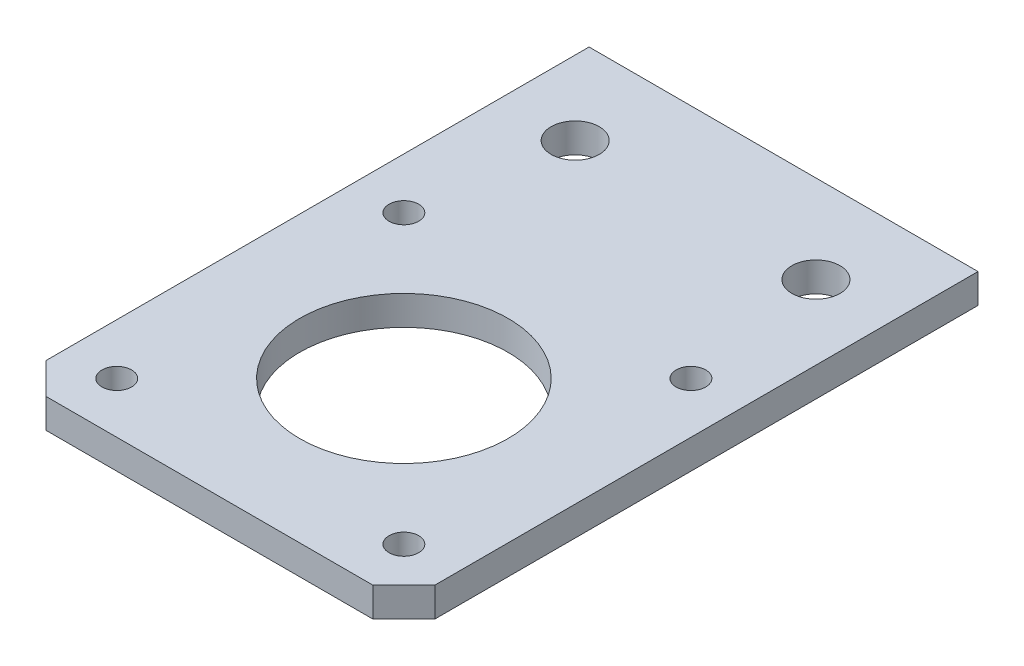
ISO-10303-21;
HEADER;
FILE_DESCRIPTION(('STEP AP214'),'2;1');
FILE_NAME('part.step','',(''),(''),'','','');
FILE_SCHEMA(('AUTOMOTIVE_DESIGN { 1 0 10303 214 1 1 1 1 }'));
ENDSEC;
DATA;
#1=APPLICATION_CONTEXT('core data for automotive mechanical design processes');
#2=APPLICATION_PROTOCOL_DEFINITION('international standard','automotive_design',2000,#1);
#3=PRODUCT_CONTEXT('',#1,'mechanical');
#4=PRODUCT('Part','Part','',(#3));
#5=PRODUCT_RELATED_PRODUCT_CATEGORY('part','',(#4));
#6=PRODUCT_DEFINITION_FORMATION('','',#4);
#7=PRODUCT_DEFINITION_CONTEXT('part definition',#1,'design');
#8=PRODUCT_DEFINITION('design','',#6,#7);
#9=PRODUCT_DEFINITION_SHAPE('','',#8);
#10=(LENGTH_UNIT() NAMED_UNIT(*) SI_UNIT(.MILLI.,.METRE.));
#11=(NAMED_UNIT(*) PLANE_ANGLE_UNIT() SI_UNIT($,.RADIAN.));
#12=(NAMED_UNIT(*) SI_UNIT($,.STERADIAN.) SOLID_ANGLE_UNIT());
#13=UNCERTAINTY_MEASURE_WITH_UNIT(LENGTH_MEASURE(1.E-05),#10,'distance_accuracy_value','');
#14=(GEOMETRIC_REPRESENTATION_CONTEXT(3) GLOBAL_UNCERTAINTY_ASSIGNED_CONTEXT((#13)) GLOBAL_UNIT_ASSIGNED_CONTEXT((#10,
#11,#12)) REPRESENTATION_CONTEXT('',''));
#15=CARTESIAN_POINT('',(0.,0.,0.));
#16=DIRECTION('',(0.,0.,1.));
#17=DIRECTION('',(1.,0.,0.));
#18=AXIS2_PLACEMENT_3D('',#15,#16,#17);
#19=CARTESIAN_POINT('',(0.,3.175,-41.));
#20=DIRECTION('',(0.,0.,1.));
#21=DIRECTION('',(1.,0.,0.));
#22=AXIS2_PLACEMENT_3D('',#19,#20,#21);
#23=PLANE('',#22);
#24=DIRECTION('',(-1.,0.,0.));
#25=VECTOR('',#24,1.);
#26=CARTESIAN_POINT('',(0.,0.,-41.));
#27=LINE('',#26,#25);
#28=CARTESIAN_POINT('',(21.,0.,-41.));
#29=VERTEX_POINT('',#28);
#30=CARTESIAN_POINT('',(-21.,0.,-41.));
#31=VERTEX_POINT('',#30);
#32=EDGE_CURVE('E138',#29,#31,#27,.T.);
#33=ORIENTED_EDGE('',*,*,#32,.T.);
#34=DIRECTION('',(0.,-1.,0.));
#35=VECTOR('',#34,1.);
#36=CARTESIAN_POINT('',(-21.,3.175,-41.));
#37=LINE('',#36,#35);
#38=CARTESIAN_POINT('',(-21.,3.175,-41.));
#39=VERTEX_POINT('',#38);
#40=EDGE_CURVE('E11',#39,#31,#37,.T.);
#41=ORIENTED_EDGE('',*,*,#40,.F.);
#42=DIRECTION('',(-1.,0.,0.));
#43=VECTOR('',#42,1.);
#44=CARTESIAN_POINT('',(0.,3.175,-41.));
#45=LINE('',#44,#43);
#46=CARTESIAN_POINT('',(21.,3.175,-41.));
#47=VERTEX_POINT('',#46);
#48=EDGE_CURVE('E178',#47,#39,#45,.T.);
#49=ORIENTED_EDGE('',*,*,#48,.F.);
#50=DIRECTION('',(0.,-1.,0.));
#51=VECTOR('',#50,1.);
#52=CARTESIAN_POINT('',(21.,3.175,-41.));
#53=LINE('',#52,#51);
#54=EDGE_CURVE('E131',#47,#29,#53,.T.);
#55=ORIENTED_EDGE('',*,*,#54,.T.);
#56=EDGE_LOOP('',(#33,#41,#49,#55));
#57=FACE_BOUND('',#56,.T.);
#58=ADVANCED_FACE('F32',(#57),#23,.F.);
#59=CARTESIAN_POINT('',(-21.,3.175,0.));
#60=DIRECTION('',(1.,0.,0.));
#61=DIRECTION('',(0.,0.,-1.));
#62=AXIS2_PLACEMENT_3D('',#59,#60,#61);
#63=PLANE('',#62);
#64=DIRECTION('',(0.,0.,1.));
#65=VECTOR('',#64,1.);
#66=CARTESIAN_POINT('',(-21.,0.,0.));
#67=LINE('',#66,#65);
#68=CARTESIAN_POINT('',(-21.,0.,17.645));
#69=VERTEX_POINT('',#68);
#70=EDGE_CURVE('E141',#31,#69,#67,.T.);
#71=ORIENTED_EDGE('',*,*,#70,.T.);
#72=DIRECTION('',(0.,-1.,0.));
#73=VECTOR('',#72,1.);
#74=CARTESIAN_POINT('',(-21.,3.175,17.645));
#75=LINE('',#74,#73);
#76=CARTESIAN_POINT('',(-21.,3.175,17.645));
#77=VERTEX_POINT('',#76);
#78=EDGE_CURVE('E41',#77,#69,#75,.T.);
#79=ORIENTED_EDGE('',*,*,#78,.F.);
#80=DIRECTION('',(0.,0.,1.));
#81=VECTOR('',#80,1.);
#82=CARTESIAN_POINT('',(-21.,3.175,0.));
#83=LINE('',#82,#81);
#84=EDGE_CURVE('E82',#39,#77,#83,.T.);
#85=ORIENTED_EDGE('',*,*,#84,.F.);
#86=ORIENTED_EDGE('',*,*,#40,.T.);
#87=EDGE_LOOP('',(#71,#79,#85,#86));
#88=FACE_BOUND('',#87,.T.);
#89=ADVANCED_FACE('F194',(#88),#63,.F.);
#90=CARTESIAN_POINT('',(-19.3225,3.175,19.3225));
#91=DIRECTION('',(0.707106781186548,0.,-0.707106781186548));
#92=DIRECTION('',(-0.707106781186548,0.,-0.707106781186548));
#93=AXIS2_PLACEMENT_3D('',#90,#91,#92);
#94=PLANE('',#93);
#95=DIRECTION('',(0.707106781186548,0.,0.707106781186548));
#96=VECTOR('',#95,1.);
#97=CARTESIAN_POINT('',(-19.3225,0.,19.3225));
#98=LINE('',#97,#96);
#99=CARTESIAN_POINT('',(-17.645,0.,21.));
#100=VERTEX_POINT('',#99);
#101=EDGE_CURVE('E143',#69,#100,#98,.T.);
#102=ORIENTED_EDGE('',*,*,#101,.T.);
#103=DIRECTION('',(0.,-1.,0.));
#104=VECTOR('',#103,1.);
#105=CARTESIAN_POINT('',(-17.645,3.175,21.));
#106=LINE('',#105,#104);
#107=CARTESIAN_POINT('',(-17.645,3.175,21.));
#108=VERTEX_POINT('',#107);
#109=EDGE_CURVE('E109',#108,#100,#106,.T.);
#110=ORIENTED_EDGE('',*,*,#109,.F.);
#111=DIRECTION('',(0.707106781186548,0.,0.707106781186548));
#112=VECTOR('',#111,1.);
#113=CARTESIAN_POINT('',(-19.3225,3.175,19.3225));
#114=LINE('',#113,#112);
#115=EDGE_CURVE('E96',#77,#108,#114,.T.);
#116=ORIENTED_EDGE('',*,*,#115,.F.);
#117=ORIENTED_EDGE('',*,*,#78,.T.);
#118=EDGE_LOOP('',(#102,#110,#116,#117));
#119=FACE_BOUND('',#118,.T.);
#120=ADVANCED_FACE('F170',(#119),#94,.F.);
#121=CARTESIAN_POINT('',(0.,3.175,21.));
#122=DIRECTION('',(0.,0.,-1.));
#123=DIRECTION('',(-1.,0.,0.));
#124=AXIS2_PLACEMENT_3D('',#121,#122,#123);
#125=PLANE('',#124);
#126=DIRECTION('',(1.,0.,0.));
#127=VECTOR('',#126,1.);
#128=CARTESIAN_POINT('',(0.,0.,21.));
#129=LINE('',#128,#127);
#130=CARTESIAN_POINT('',(17.645,0.,21.));
#131=VERTEX_POINT('',#130);
#132=EDGE_CURVE('E105',#100,#131,#129,.T.);
#133=ORIENTED_EDGE('',*,*,#132,.T.);
#134=DIRECTION('',(0.,-1.,0.));
#135=VECTOR('',#134,1.);
#136=CARTESIAN_POINT('',(17.645,3.175,21.));
#137=LINE('',#136,#135);
#138=CARTESIAN_POINT('',(17.645,3.175,21.));
#139=VERTEX_POINT('',#138);
#140=EDGE_CURVE('E102',#139,#131,#137,.T.);
#141=ORIENTED_EDGE('',*,*,#140,.F.);
#142=DIRECTION('',(1.,0.,0.));
#143=VECTOR('',#142,1.);
#144=CARTESIAN_POINT('',(0.,3.175,21.));
#145=LINE('',#144,#143);
#146=EDGE_CURVE('E89',#108,#139,#145,.T.);
#147=ORIENTED_EDGE('',*,*,#146,.F.);
#148=ORIENTED_EDGE('',*,*,#109,.T.);
#149=EDGE_LOOP('',(#133,#141,#147,#148));
#150=FACE_BOUND('',#149,.T.);
#151=ADVANCED_FACE('F103',(#150),#125,.F.);
#152=CARTESIAN_POINT('',(19.3225,3.175,19.3225));
#153=DIRECTION('',(0.707106781186548,0.,0.707106781186548));
#154=DIRECTION('',(0.707106781186548,0.,-0.707106781186548));
#155=AXIS2_PLACEMENT_3D('',#152,#153,#154);
#156=PLANE('',#155);
#157=DIRECTION('',(-0.707106781186548,0.,0.707106781186548));
#158=VECTOR('',#157,1.);
#159=CARTESIAN_POINT('',(19.3225,0.,19.3225));
#160=LINE('',#159,#158);
#161=CARTESIAN_POINT('',(21.,0.,17.645));
#162=VERTEX_POINT('',#161);
#163=EDGE_CURVE('E146',#162,#131,#160,.T.);
#164=ORIENTED_EDGE('',*,*,#163,.F.);
#165=DIRECTION('',(0.,-1.,0.));
#166=VECTOR('',#165,1.);
#167=CARTESIAN_POINT('',(21.,3.175,17.645));
#168=LINE('',#167,#166);
#169=CARTESIAN_POINT('',(21.,3.175,17.645));
#170=VERTEX_POINT('',#169);
#171=EDGE_CURVE('E71',#170,#162,#168,.T.);
#172=ORIENTED_EDGE('',*,*,#171,.F.);
#173=DIRECTION('',(-0.707106781186548,0.,0.707106781186548));
#174=VECTOR('',#173,1.);
#175=CARTESIAN_POINT('',(19.3225,3.175,19.3225));
#176=LINE('',#175,#174);
#177=EDGE_CURVE('E94',#170,#139,#176,.T.);
#178=ORIENTED_EDGE('',*,*,#177,.T.);
#179=ORIENTED_EDGE('',*,*,#140,.T.);
#180=EDGE_LOOP('',(#164,#172,#178,#179));
#181=FACE_BOUND('',#180,.T.);
#182=ADVANCED_FACE('F111',(#181),#156,.T.);
#183=CARTESIAN_POINT('',(-15.5,3.175,15.5));
#184=DIRECTION('',(0.,-1.,0.));
#185=DIRECTION('',(0.,0.,-1.));
#186=AXIS2_PLACEMENT_3D('',#183,#184,#185);
#187=CYLINDRICAL_SURFACE('',#186,1.60000000000005);
#188=CARTESIAN_POINT('',(-15.5,3.175,15.5));
#189=DIRECTION('',(0.,1.,0.));
#190=DIRECTION('',(0.,0.,1.));
#191=AXIS2_PLACEMENT_3D('',#188,#189,#190);
#192=CIRCLE('',#191,1.60000000000005);
#193=CARTESIAN_POINT('',(-15.5,3.175,17.1));
#194=VERTEX_POINT('',#193);
#195=EDGE_CURVE('E125',#194,#194,#192,.T.);
#196=ORIENTED_EDGE('',*,*,#195,.T.);
#197=EDGE_LOOP('',(#196));
#198=FACE_BOUND('',#197,.T.);
#199=CARTESIAN_POINT('',(-15.5,0.,15.5));
#200=DIRECTION('',(0.,1.,0.));
#201=DIRECTION('',(0.,0.,1.));
#202=AXIS2_PLACEMENT_3D('',#199,#200,#201);
#203=CIRCLE('',#202,1.60000000000005);
#204=CARTESIAN_POINT('',(-15.5,0.,17.1));
#205=VERTEX_POINT('',#204);
#206=EDGE_CURVE('E158',#205,#205,#203,.T.);
#207=ORIENTED_EDGE('',*,*,#206,.F.);
#208=EDGE_LOOP('',(#207));
#209=FACE_BOUND('',#208,.T.);
#210=ADVANCED_FACE('F205',(#198,#209),#187,.F.);
#211=CARTESIAN_POINT('',(-15.5,3.175,-15.5));
#212=DIRECTION('',(0.,-1.,0.));
#213=DIRECTION('',(0.,0.,-1.));
#214=AXIS2_PLACEMENT_3D('',#211,#212,#213);
#215=CYLINDRICAL_SURFACE('',#214,1.60000000000024);
#216=CARTESIAN_POINT('',(-15.5,3.175,-15.5));
#217=DIRECTION('',(0.,1.,0.));
#218=DIRECTION('',(0.,0.,1.));
#219=AXIS2_PLACEMENT_3D('',#216,#217,#218);
#220=CIRCLE('',#219,1.60000000000024);
#221=CARTESIAN_POINT('',(-15.5,3.175,-13.8999999999998));
#222=VERTEX_POINT('',#221);
#223=EDGE_CURVE('E122',#222,#222,#220,.T.);
#224=ORIENTED_EDGE('',*,*,#223,.T.);
#225=EDGE_LOOP('',(#224));
#226=FACE_BOUND('',#225,.T.);
#227=CARTESIAN_POINT('',(-15.5,0.,-15.5));
#228=DIRECTION('',(0.,1.,0.));
#229=DIRECTION('',(0.,0.,1.));
#230=AXIS2_PLACEMENT_3D('',#227,#228,#229);
#231=CIRCLE('',#230,1.60000000000024);
#232=CARTESIAN_POINT('',(-15.5,0.,-13.8999999999998));
#233=VERTEX_POINT('',#232);
#234=EDGE_CURVE('E155',#233,#233,#231,.T.);
#235=ORIENTED_EDGE('',*,*,#234,.F.);
#236=EDGE_LOOP('',(#235));
#237=FACE_BOUND('',#236,.T.);
#238=ADVANCED_FACE('F209',(#226,#237),#215,.F.);
#239=CARTESIAN_POINT('',(15.5,3.175,-15.5));
#240=DIRECTION('',(0.,-1.,0.));
#241=DIRECTION('',(0.,0.,-1.));
#242=AXIS2_PLACEMENT_3D('',#239,#240,#241);
#243=CYLINDRICAL_SURFACE('',#242,1.60000000000016);
#244=CARTESIAN_POINT('',(15.5,3.175,-15.5));
#245=DIRECTION('',(0.,1.,0.));
#246=DIRECTION('',(0.,0.,1.));
#247=AXIS2_PLACEMENT_3D('',#244,#245,#246);
#248=CIRCLE('',#247,1.60000000000016);
#249=CARTESIAN_POINT('',(15.5,3.175,-13.8999999999998));
#250=VERTEX_POINT('',#249);
#251=EDGE_CURVE('E119',#250,#250,#248,.T.);
#252=ORIENTED_EDGE('',*,*,#251,.T.);
#253=EDGE_LOOP('',(#252));
#254=FACE_BOUND('',#253,.T.);
#255=CARTESIAN_POINT('',(15.5,0.,-15.5));
#256=DIRECTION('',(0.,1.,0.));
#257=DIRECTION('',(0.,0.,1.));
#258=AXIS2_PLACEMENT_3D('',#255,#256,#257);
#259=CIRCLE('',#258,1.60000000000016);
#260=CARTESIAN_POINT('',(15.5,0.,-13.8999999999998));
#261=VERTEX_POINT('',#260);
#262=EDGE_CURVE('E152',#261,#261,#259,.T.);
#263=ORIENTED_EDGE('',*,*,#262,.F.);
#264=EDGE_LOOP('',(#263));
#265=FACE_BOUND('',#264,.T.);
#266=ADVANCED_FACE('F189',(#254,#265),#243,.F.);
#267=CARTESIAN_POINT('',(15.5,3.175,15.5));
#268=DIRECTION('',(0.,-1.,0.));
#269=DIRECTION('',(0.,0.,-1.));
#270=AXIS2_PLACEMENT_3D('',#267,#268,#269);
#271=CYLINDRICAL_SURFACE('',#270,1.60000000000001);
#272=CARTESIAN_POINT('',(15.5,3.175,15.5));
#273=DIRECTION('',(0.,1.,0.));
#274=DIRECTION('',(0.,0.,1.));
#275=AXIS2_PLACEMENT_3D('',#272,#273,#274);
#276=CIRCLE('',#275,1.60000000000001);
#277=CARTESIAN_POINT('',(15.5,3.175,17.1));
#278=VERTEX_POINT('',#277);
#279=EDGE_CURVE('E113',#278,#278,#276,.T.);
#280=ORIENTED_EDGE('',*,*,#279,.T.);
#281=EDGE_LOOP('',(#280));
#282=FACE_BOUND('',#281,.T.);
#283=CARTESIAN_POINT('',(15.5,0.,15.5));
#284=DIRECTION('',(0.,1.,0.));
#285=DIRECTION('',(0.,0.,1.));
#286=AXIS2_PLACEMENT_3D('',#283,#284,#285);
#287=CIRCLE('',#286,1.60000000000001);
#288=CARTESIAN_POINT('',(15.5,0.,17.1));
#289=VERTEX_POINT('',#288);
#290=EDGE_CURVE('E149',#289,#289,#287,.T.);
#291=ORIENTED_EDGE('',*,*,#290,.F.);
#292=EDGE_LOOP('',(#291));
#293=FACE_BOUND('',#292,.T.);
#294=ADVANCED_FACE('F182',(#282,#293),#271,.F.);
#295=CARTESIAN_POINT('',(21.,3.175,0.));
#296=DIRECTION('',(-1.,0.,0.));
#297=DIRECTION('',(0.,0.,1.));
#298=AXIS2_PLACEMENT_3D('',#295,#296,#297);
#299=PLANE('',#298);
#300=DIRECTION('',(0.,0.,-1.));
#301=VECTOR('',#300,1.);
#302=CARTESIAN_POINT('',(21.,0.,0.));
#303=LINE('',#302,#301);
#304=EDGE_CURVE('E74',#162,#29,#303,.T.);
#305=ORIENTED_EDGE('',*,*,#304,.T.);
#306=ORIENTED_EDGE('',*,*,#54,.F.);
#307=DIRECTION('',(0.,0.,-1.));
#308=VECTOR('',#307,1.);
#309=CARTESIAN_POINT('',(21.,3.175,0.));
#310=LINE('',#309,#308);
#311=EDGE_CURVE('E49',#170,#47,#310,.T.);
#312=ORIENTED_EDGE('',*,*,#311,.F.);
#313=ORIENTED_EDGE('',*,*,#171,.T.);
#314=EDGE_LOOP('',(#305,#306,#312,#313));
#315=FACE_BOUND('',#314,.T.);
#316=ADVANCED_FACE('F179',(#315),#299,.F.);
#317=CARTESIAN_POINT('',(13.,3.175,-31.5));
#318=DIRECTION('',(0.,-1.,0.));
#319=DIRECTION('',(0.,0.,-1.));
#320=AXIS2_PLACEMENT_3D('',#317,#318,#319);
#321=CYLINDRICAL_SURFACE('',#320,2.6);
#322=CARTESIAN_POINT('',(13.,3.175,-31.5));
#323=DIRECTION('',(0.,1.,0.));
#324=DIRECTION('',(0.,0.,1.));
#325=AXIS2_PLACEMENT_3D('',#322,#323,#324);
#326=CIRCLE('',#325,2.6);
#327=CARTESIAN_POINT('',(13.,3.175,-28.9));
#328=VERTEX_POINT('',#327);
#329=EDGE_CURVE('E259',#328,#328,#326,.T.);
#330=ORIENTED_EDGE('',*,*,#329,.T.);
#331=EDGE_LOOP('',(#330));
#332=FACE_BOUND('',#331,.T.);
#333=CARTESIAN_POINT('',(13.,0.,-31.5));
#334=DIRECTION('',(0.,1.,0.));
#335=DIRECTION('',(0.,0.,1.));
#336=AXIS2_PLACEMENT_3D('',#333,#334,#335);
#337=CIRCLE('',#336,2.6);
#338=CARTESIAN_POINT('',(13.,0.,-28.9));
#339=VERTEX_POINT('',#338);
#340=EDGE_CURVE('E135',#339,#339,#337,.T.);
#341=ORIENTED_EDGE('',*,*,#340,.F.);
#342=EDGE_LOOP('',(#341));
#343=FACE_BOUND('',#342,.T.);
#344=ADVANCED_FACE('F181',(#332,#343),#321,.F.);
#345=CARTESIAN_POINT('',(-13.,3.175,-31.5));
#346=DIRECTION('',(0.,-1.,0.));
#347=DIRECTION('',(0.,0.,-1.));
#348=AXIS2_PLACEMENT_3D('',#345,#346,#347);
#349=CYLINDRICAL_SURFACE('',#348,2.6);
#350=CARTESIAN_POINT('',(-13.,3.175,-31.5));
#351=DIRECTION('',(0.,1.,0.));
#352=DIRECTION('',(0.,0.,1.));
#353=AXIS2_PLACEMENT_3D('',#350,#351,#352);
#354=CIRCLE('',#353,2.6);
#355=CARTESIAN_POINT('',(-13.,3.175,-28.9));
#356=VERTEX_POINT('',#355);
#357=EDGE_CURVE('E164',#356,#356,#354,.T.);
#358=ORIENTED_EDGE('',*,*,#357,.T.);
#359=EDGE_LOOP('',(#358));
#360=FACE_BOUND('',#359,.T.);
#361=CARTESIAN_POINT('',(-13.,0.,-31.5));
#362=DIRECTION('',(0.,1.,0.));
#363=DIRECTION('',(0.,0.,1.));
#364=AXIS2_PLACEMENT_3D('',#361,#362,#363);
#365=CIRCLE('',#364,2.6);
#366=CARTESIAN_POINT('',(-13.,0.,-28.9));
#367=VERTEX_POINT('',#366);
#368=EDGE_CURVE('E132',#367,#367,#365,.T.);
#369=ORIENTED_EDGE('',*,*,#368,.F.);
#370=EDGE_LOOP('',(#369));
#371=FACE_BOUND('',#370,.T.);
#372=ADVANCED_FACE('F34',(#360,#371),#349,.F.);
#373=CARTESIAN_POINT('',(0.,3.175,0.));
#374=DIRECTION('',(0.,-1.,0.));
#375=DIRECTION('',(0.,0.,-1.));
#376=AXIS2_PLACEMENT_3D('',#373,#374,#375);
#377=CYLINDRICAL_SURFACE('',#376,11.2500000000001);
#378=CARTESIAN_POINT('',(0.,3.175,0.));
#379=DIRECTION('',(0.,1.,0.));
#380=DIRECTION('',(0.,0.,1.));
#381=AXIS2_PLACEMENT_3D('',#378,#379,#380);
#382=CIRCLE('',#381,11.2500000000001);
#383=CARTESIAN_POINT('',(0.,3.175,11.2500000000001));
#384=VERTEX_POINT('',#383);
#385=EDGE_CURVE('E128',#384,#384,#382,.T.);
#386=ORIENTED_EDGE('',*,*,#385,.T.);
#387=EDGE_LOOP('',(#386));
#388=FACE_BOUND('',#387,.T.);
#389=CARTESIAN_POINT('',(0.,0.,0.));
#390=DIRECTION('',(0.,1.,0.));
#391=DIRECTION('',(0.,0.,1.));
#392=AXIS2_PLACEMENT_3D('',#389,#390,#391);
#393=CIRCLE('',#392,11.2500000000001);
#394=CARTESIAN_POINT('',(0.,0.,11.2500000000001));
#395=VERTEX_POINT('',#394);
#396=EDGE_CURVE('E161',#395,#395,#393,.T.);
#397=ORIENTED_EDGE('',*,*,#396,.F.);
#398=EDGE_LOOP('',(#397));
#399=FACE_BOUND('',#398,.T.);
#400=ADVANCED_FACE('F219',(#388,#399),#377,.F.);
#401=CARTESIAN_POINT('',(0.,3.175,0.));
#402=DIRECTION('',(0.,1.,0.));
#403=DIRECTION('',(0.,0.,1.));
#404=AXIS2_PLACEMENT_3D('',#401,#402,#403);
#405=PLANE('',#404);
#406=ORIENTED_EDGE('',*,*,#357,.F.);
#407=EDGE_LOOP('',(#406));
#408=FACE_BOUND('',#407,.T.);
#409=ORIENTED_EDGE('',*,*,#329,.F.);
#410=EDGE_LOOP('',(#409));
#411=FACE_BOUND('',#410,.T.);
#412=ORIENTED_EDGE('',*,*,#48,.T.);
#413=ORIENTED_EDGE('',*,*,#84,.T.);
#414=ORIENTED_EDGE('',*,*,#115,.T.);
#415=ORIENTED_EDGE('',*,*,#146,.T.);
#416=ORIENTED_EDGE('',*,*,#177,.F.);
#417=ORIENTED_EDGE('',*,*,#311,.T.);
#418=EDGE_LOOP('',(#412,#413,#414,#415,#416,#417));
#419=FACE_BOUND('',#418,.T.);
#420=ORIENTED_EDGE('',*,*,#279,.F.);
#421=EDGE_LOOP('',(#420));
#422=FACE_BOUND('',#421,.T.);
#423=ORIENTED_EDGE('',*,*,#251,.F.);
#424=EDGE_LOOP('',(#423));
#425=FACE_BOUND('',#424,.T.);
#426=ORIENTED_EDGE('',*,*,#223,.F.);
#427=EDGE_LOOP('',(#426));
#428=FACE_BOUND('',#427,.T.);
#429=ORIENTED_EDGE('',*,*,#195,.F.);
#430=EDGE_LOOP('',(#429));
#431=FACE_BOUND('',#430,.T.);
#432=ORIENTED_EDGE('',*,*,#385,.F.);
#433=EDGE_LOOP('',(#432));
#434=FACE_BOUND('',#433,.T.);
#435=ADVANCED_FACE('F91',(#408,#411,#419,#422,#425,#428,#431,#434),#405,.T.);
#436=CARTESIAN_POINT('',(0.,0.,0.));
#437=DIRECTION('',(0.,1.,0.));
#438=DIRECTION('',(0.,0.,1.));
#439=AXIS2_PLACEMENT_3D('',#436,#437,#438);
#440=PLANE('',#439);
#441=ORIENTED_EDGE('',*,*,#368,.T.);
#442=EDGE_LOOP('',(#441));
#443=FACE_BOUND('',#442,.T.);
#444=ORIENTED_EDGE('',*,*,#340,.T.);
#445=EDGE_LOOP('',(#444));
#446=FACE_BOUND('',#445,.T.);
#447=ORIENTED_EDGE('',*,*,#32,.F.);
#448=ORIENTED_EDGE('',*,*,#304,.F.);
#449=ORIENTED_EDGE('',*,*,#163,.T.);
#450=ORIENTED_EDGE('',*,*,#132,.F.);
#451=ORIENTED_EDGE('',*,*,#101,.F.);
#452=ORIENTED_EDGE('',*,*,#70,.F.);
#453=EDGE_LOOP('',(#447,#448,#449,#450,#451,#452));
#454=FACE_BOUND('',#453,.T.);
#455=ORIENTED_EDGE('',*,*,#290,.T.);
#456=EDGE_LOOP('',(#455));
#457=FACE_BOUND('',#456,.T.);
#458=ORIENTED_EDGE('',*,*,#262,.T.);
#459=EDGE_LOOP('',(#458));
#460=FACE_BOUND('',#459,.T.);
#461=ORIENTED_EDGE('',*,*,#234,.T.);
#462=EDGE_LOOP('',(#461));
#463=FACE_BOUND('',#462,.T.);
#464=ORIENTED_EDGE('',*,*,#206,.T.);
#465=EDGE_LOOP('',(#464));
#466=FACE_BOUND('',#465,.T.);
#467=ORIENTED_EDGE('',*,*,#396,.T.);
#468=EDGE_LOOP('',(#467));
#469=FACE_BOUND('',#468,.T.);
#470=ADVANCED_FACE('F173',(#443,#446,#454,#457,#460,#463,#466,#469),#440,.F.);
#471=CLOSED_SHELL('',(#58,#89,#120,#151,#182,#210,#238,#266,#294,#316,#344,#372,#400,#435,#470));
#472=MANIFOLD_SOLID_BREP('B2',#471);
#473=ADVANCED_BREP_SHAPE_REPRESENTATION('',(#18,#472),#14);
#474=SHAPE_DEFINITION_REPRESENTATION(#9,#473);
ENDSEC;
END-ISO-10303-21;
